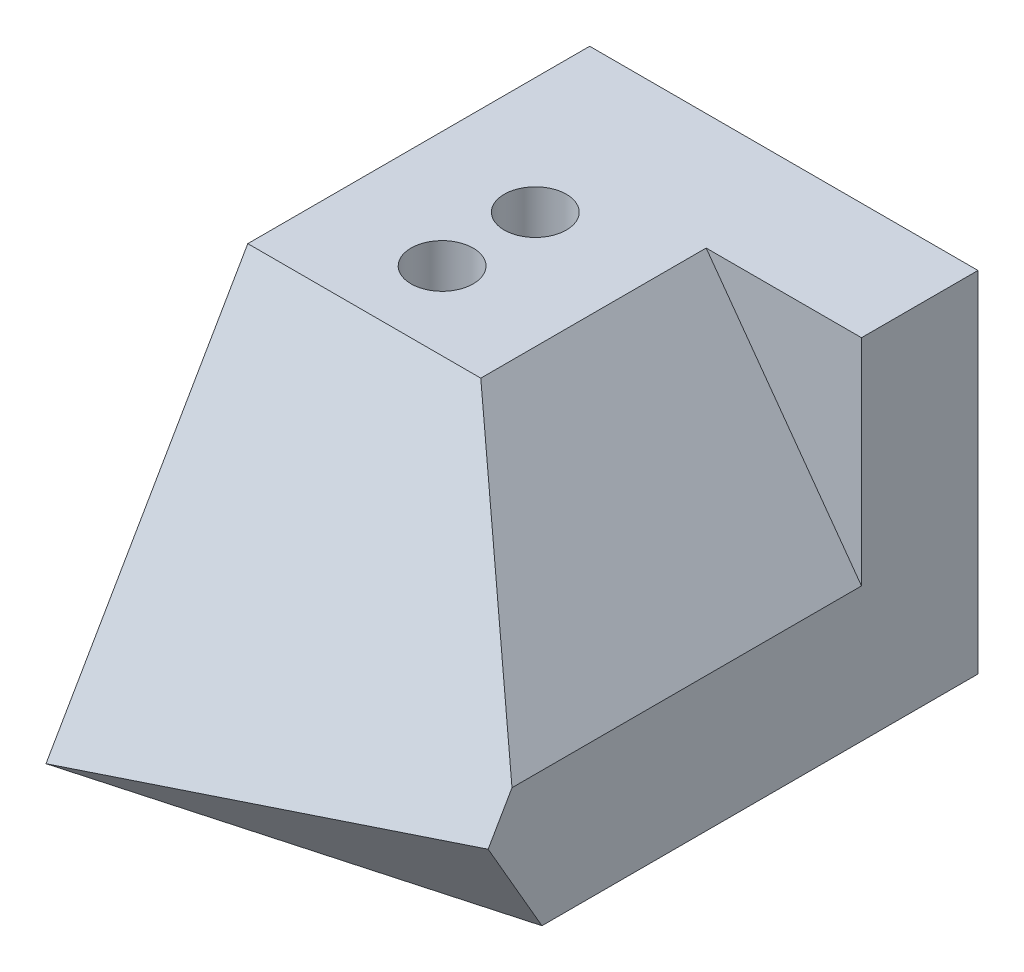
ISO-10303-21;
HEADER;
FILE_DESCRIPTION(('STEP AP214'),'2;1');
FILE_NAME('part.step','',(''),(''),'','','');
FILE_SCHEMA(('AUTOMOTIVE_DESIGN { 1 0 10303 214 1 1 1 1 }'));
ENDSEC;
DATA;
#1=APPLICATION_CONTEXT('core data for automotive mechanical design processes');
#2=APPLICATION_PROTOCOL_DEFINITION('international standard','automotive_design',2000,#1);
#3=PRODUCT_CONTEXT('',#1,'mechanical');
#4=PRODUCT('Part','Part','',(#3));
#5=PRODUCT_RELATED_PRODUCT_CATEGORY('part','',(#4));
#6=PRODUCT_DEFINITION_FORMATION('','',#4);
#7=PRODUCT_DEFINITION_CONTEXT('part definition',#1,'design');
#8=PRODUCT_DEFINITION('design','',#6,#7);
#9=PRODUCT_DEFINITION_SHAPE('','',#8);
#10=(LENGTH_UNIT() NAMED_UNIT(*) SI_UNIT(.MILLI.,.METRE.));
#11=(NAMED_UNIT(*) PLANE_ANGLE_UNIT() SI_UNIT($,.RADIAN.));
#12=(NAMED_UNIT(*) SI_UNIT($,.STERADIAN.) SOLID_ANGLE_UNIT());
#13=UNCERTAINTY_MEASURE_WITH_UNIT(LENGTH_MEASURE(1.E-05),#10,'distance_accuracy_value','');
#14=(GEOMETRIC_REPRESENTATION_CONTEXT(3) GLOBAL_UNCERTAINTY_ASSIGNED_CONTEXT((#13)) GLOBAL_UNIT_ASSIGNED_CONTEXT((#10,
#11,#12)) REPRESENTATION_CONTEXT('',''));
#15=CARTESIAN_POINT('',(0.,0.,0.));
#16=DIRECTION('',(0.,0.,1.));
#17=DIRECTION('',(1.,0.,0.));
#18=AXIS2_PLACEMENT_3D('',#15,#16,#17);
#19=CARTESIAN_POINT('',(50.,45.,35.));
#20=DIRECTION('',(-1.,0.,0.));
#21=DIRECTION('',(0.,0.,1.));
#22=AXIS2_PLACEMENT_3D('',#19,#20,#21);
#23=PLANE('',#22);
#24=DIRECTION('',(0.,0.,-1.));
#25=VECTOR('',#24,1.);
#26=CARTESIAN_POINT('',(50.,17.3205080756888,35.));
#27=LINE('',#26,#25);
#28=CARTESIAN_POINT('',(50.,17.3205080756888,25.0000000000001));
#29=VERTEX_POINT('',#28);
#30=CARTESIAN_POINT('',(50.,17.3205080756888,-20.));
#31=VERTEX_POINT('',#30);
#32=EDGE_CURVE('E196',#29,#31,#27,.T.);
#33=ORIENTED_EDGE('',*,*,#32,.F.);
#34=DIRECTION('',(0.,0.866025403784442,-0.499999999999995));
#35=VECTOR('',#34,1.);
#36=CARTESIAN_POINT('',(50.,15.1554445662276,26.2500000000002));
#37=LINE('',#36,#35);
#38=CARTESIAN_POINT('',(50.,12.,28.0717967697246));
#39=VERTEX_POINT('',#38);
#40=EDGE_CURVE('E141',#39,#29,#37,.T.);
#41=ORIENTED_EDGE('',*,*,#40,.F.);
#42=DIRECTION('',(0.,0.86602540378444,0.499999999999998));
#43=VECTOR('',#42,1.);
#44=CARTESIAN_POINT('',(50.,-48.6217782649108,-6.92820323027527));
#45=LINE('',#44,#43);
#46=CARTESIAN_POINT('',(50.,0.,21.1435935394491));
#47=VERTEX_POINT('',#46);
#48=EDGE_CURVE('E61',#47,#39,#45,.T.);
#49=ORIENTED_EDGE('',*,*,#48,.F.);
#50=DIRECTION('',(0.,0.,-1.));
#51=VECTOR('',#50,1.);
#52=CARTESIAN_POINT('',(50.,0.,35.));
#53=LINE('',#52,#51);
#54=CARTESIAN_POINT('',(50.,0.,-35.));
#55=VERTEX_POINT('',#54);
#56=EDGE_CURVE('E114',#47,#55,#53,.T.);
#57=ORIENTED_EDGE('',*,*,#56,.T.);
#58=DIRECTION('',(0.,1.,0.));
#59=VECTOR('',#58,1.);
#60=CARTESIAN_POINT('',(50.,45.,-35.));
#61=LINE('',#60,#59);
#62=CARTESIAN_POINT('',(50.,45.,-35.));
#63=VERTEX_POINT('',#62);
#64=EDGE_CURVE('E112',#55,#63,#61,.T.);
#65=ORIENTED_EDGE('',*,*,#64,.T.);
#66=DIRECTION('',(0.,0.,-1.));
#67=VECTOR('',#66,1.);
#68=CARTESIAN_POINT('',(50.,45.,35.));
#69=LINE('',#68,#67);
#70=CARTESIAN_POINT('',(50.,45.,-20.));
#71=VERTEX_POINT('',#70);
#72=EDGE_CURVE('E107',#71,#63,#69,.T.);
#73=ORIENTED_EDGE('',*,*,#72,.F.);
#74=DIRECTION('',(0.,1.,0.));
#75=VECTOR('',#74,1.);
#76=CARTESIAN_POINT('',(50.,0.,-20.));
#77=LINE('',#76,#75);
#78=EDGE_CURVE('E95',#31,#71,#77,.T.);
#79=ORIENTED_EDGE('',*,*,#78,.F.);
#80=EDGE_LOOP('',(#33,#41,#49,#57,#65,#73,#79));
#81=FACE_BOUND('',#80,.T.);
#82=ADVANCED_FACE('F39',(#81),#23,.F.);
#83=CARTESIAN_POINT('',(0.,45.,35.));
#84=DIRECTION('',(0.,-1.,0.));
#85=DIRECTION('',(0.,0.,-1.));
#86=AXIS2_PLACEMENT_3D('',#83,#84,#85);
#87=PLANE('',#86);
#88=CARTESIAN_POINT('',(15.,45.,-0.999999999999997));
#89=DIRECTION('',(0.,1.,0.));
#90=DIRECTION('',(0.,0.,1.));
#91=AXIS2_PLACEMENT_3D('',#88,#89,#90);
#92=CIRCLE('',#91,4.);
#93=CARTESIAN_POINT('',(15.,45.,3.));
#94=VERTEX_POINT('',#93);
#95=EDGE_CURVE('E172',#94,#94,#92,.T.);
#96=ORIENTED_EDGE('',*,*,#95,.F.);
#97=EDGE_LOOP('',(#96));
#98=FACE_BOUND('',#97,.T.);
#99=CARTESIAN_POINT('',(15.,45.,-13.));
#100=DIRECTION('',(0.,1.,0.));
#101=DIRECTION('',(0.,0.,1.));
#102=AXIS2_PLACEMENT_3D('',#99,#100,#101);
#103=CIRCLE('',#102,4.);
#104=CARTESIAN_POINT('',(15.,45.,-9.));
#105=VERTEX_POINT('',#104);
#106=EDGE_CURVE('E175',#105,#105,#103,.T.);
#107=ORIENTED_EDGE('',*,*,#106,.F.);
#108=EDGE_LOOP('',(#107));
#109=FACE_BOUND('',#108,.T.);
#110=DIRECTION('',(0.,0.,-1.));
#111=VECTOR('',#110,1.);
#112=CARTESIAN_POINT('',(30.,45.,35.));
#113=LINE('',#112,#111);
#114=CARTESIAN_POINT('',(30.,45.,9.01923788646722));
#115=VERTEX_POINT('',#114);
#116=CARTESIAN_POINT('',(30.,45.,-20.));
#117=VERTEX_POINT('',#116);
#118=EDGE_CURVE('E54',#115,#117,#113,.T.);
#119=ORIENTED_EDGE('',*,*,#118,.T.);
#120=DIRECTION('',(-1.,0.,0.));
#121=VECTOR('',#120,1.);
#122=CARTESIAN_POINT('',(0.,45.,-20.));
#123=LINE('',#122,#121);
#124=EDGE_CURVE('E98',#71,#117,#123,.T.);
#125=ORIENTED_EDGE('',*,*,#124,.F.);
#126=ORIENTED_EDGE('',*,*,#72,.T.);
#127=DIRECTION('',(-1.,0.,0.));
#128=VECTOR('',#127,1.);
#129=CARTESIAN_POINT('',(0.,45.,-35.));
#130=LINE('',#129,#128);
#131=CARTESIAN_POINT('',(0.,45.,-35.));
#132=VERTEX_POINT('',#131);
#133=EDGE_CURVE('E118',#63,#132,#130,.T.);
#134=ORIENTED_EDGE('',*,*,#133,.T.);
#135=DIRECTION('',(0.,0.,-1.));
#136=VECTOR('',#135,1.);
#137=CARTESIAN_POINT('',(0.,45.,35.));
#138=LINE('',#137,#136);
#139=CARTESIAN_POINT('',(0.,45.,9.01923788646721));
#140=VERTEX_POINT('',#139);
#141=EDGE_CURVE('E115',#140,#132,#138,.T.);
#142=ORIENTED_EDGE('',*,*,#141,.F.);
#143=DIRECTION('',(-1.,0.,0.));
#144=VECTOR('',#143,1.);
#145=CARTESIAN_POINT('',(50.,45.,9.01923788646721));
#146=LINE('',#145,#144);
#147=EDGE_CURVE('E138',#115,#140,#146,.T.);
#148=ORIENTED_EDGE('',*,*,#147,.F.);
#149=EDGE_LOOP('',(#119,#125,#126,#134,#142,#148));
#150=FACE_BOUND('',#149,.T.);
#151=ADVANCED_FACE('F105',(#98,#109,#150),#87,.F.);
#152=CARTESIAN_POINT('',(50.,15.1554445662276,26.2500000000002));
#153=DIRECTION('',(0.,0.499999999999995,0.866025403784442));
#154=DIRECTION('',(0.,-0.866025403784442,0.499999999999995));
#155=AXIS2_PLACEMENT_3D('',#152,#153,#154);
#156=PLANE('',#155);
#157=ORIENTED_EDGE('',*,*,#40,.T.);
#158=DIRECTION('',(-0.530457508835614,0.73413971660028,-0.423855763001961));
#159=VECTOR('',#158,1.);
#160=CARTESIAN_POINT('',(51.1241873607383,15.7646613270404,25.8982685391501));
#161=LINE('',#160,#159);
#162=EDGE_CURVE('E11',#29,#115,#161,.T.);
#163=ORIENTED_EDGE('',*,*,#162,.T.);
#164=ORIENTED_EDGE('',*,*,#147,.T.);
#165=DIRECTION('',(0.,0.866025403784442,-0.499999999999995));
#166=VECTOR('',#165,1.);
#167=CARTESIAN_POINT('',(0.,15.1554445662276,26.2500000000002));
#168=LINE('',#167,#166);
#169=CARTESIAN_POINT('',(0.,0.,35.));
#170=VERTEX_POINT('',#169);
#171=EDGE_CURVE('E192',#170,#140,#168,.T.);
#172=ORIENTED_EDGE('',*,*,#171,.F.);
#173=DIRECTION('',(-0.963679180614625,-0.23128300334751,0.133531304241668));
#174=VECTOR('',#173,1.);
#175=CARTESIAN_POINT('',(4.50384682503045,1.08092323800731,34.3759286775632));
#176=LINE('',#175,#174);
#177=EDGE_CURVE('E177',#39,#170,#176,.T.);
#178=ORIENTED_EDGE('',*,*,#177,.F.);
#179=EDGE_LOOP('',(#157,#163,#164,#172,#178));
#180=FACE_BOUND('',#179,.T.);
#181=ADVANCED_FACE('F163',(#180),#156,.T.);
#182=CARTESIAN_POINT('',(0.,45.,35.));
#183=DIRECTION('',(1.,0.,0.));
#184=DIRECTION('',(0.,1.,0.));
#185=AXIS2_PLACEMENT_3D('',#182,#183,#184);
#186=PLANE('',#185);
#187=ORIENTED_EDGE('',*,*,#171,.T.);
#188=ORIENTED_EDGE('',*,*,#141,.T.);
#189=DIRECTION('',(0.,-1.,0.));
#190=VECTOR('',#189,1.);
#191=CARTESIAN_POINT('',(0.,45.,-35.));
#192=LINE('',#191,#190);
#193=CARTESIAN_POINT('',(0.,0.,-35.));
#194=VERTEX_POINT('',#193);
#195=EDGE_CURVE('E135',#132,#194,#192,.T.);
#196=ORIENTED_EDGE('',*,*,#195,.T.);
#197=DIRECTION('',(0.,0.,-1.));
#198=VECTOR('',#197,1.);
#199=CARTESIAN_POINT('',(0.,0.,35.));
#200=LINE('',#199,#198);
#201=EDGE_CURVE('E47',#170,#194,#200,.T.);
#202=ORIENTED_EDGE('',*,*,#201,.F.);
#203=EDGE_LOOP('',(#187,#188,#196,#202));
#204=FACE_BOUND('',#203,.T.);
#205=ADVANCED_FACE('F41',(#204),#186,.F.);
#206=CARTESIAN_POINT('',(0.,0.,35.));
#207=DIRECTION('',(0.,1.,0.));
#208=DIRECTION('',(0.,0.,1.));
#209=AXIS2_PLACEMENT_3D('',#206,#207,#208);
#210=PLANE('',#209);
#211=CARTESIAN_POINT('',(15.,0.,-13.));
#212=DIRECTION('',(0.,1.,0.));
#213=DIRECTION('',(0.,0.,1.));
#214=AXIS2_PLACEMENT_3D('',#211,#212,#213);
#215=CIRCLE('',#214,4.);
#216=CARTESIAN_POINT('',(15.,0.,-9.));
#217=VERTEX_POINT('',#216);
#218=EDGE_CURVE('E178',#217,#217,#215,.T.);
#219=ORIENTED_EDGE('',*,*,#218,.T.);
#220=EDGE_LOOP('',(#219));
#221=FACE_BOUND('',#220,.T.);
#222=CARTESIAN_POINT('',(15.,0.,-0.999999999999997));
#223=DIRECTION('',(0.,1.,0.));
#224=DIRECTION('',(0.,0.,1.));
#225=AXIS2_PLACEMENT_3D('',#222,#223,#224);
#226=CIRCLE('',#225,4.);
#227=CARTESIAN_POINT('',(15.,0.,3.));
#228=VERTEX_POINT('',#227);
#229=EDGE_CURVE('E182',#228,#228,#226,.T.);
#230=ORIENTED_EDGE('',*,*,#229,.T.);
#231=EDGE_LOOP('',(#230));
#232=FACE_BOUND('',#231,.T.);
#233=ORIENTED_EDGE('',*,*,#56,.F.);
#234=DIRECTION('',(-0.963679180614625,0.,0.267062608483337));
#235=VECTOR('',#234,1.);
#236=CARTESIAN_POINT('',(0.,0.,35.));
#237=LINE('',#236,#235);
#238=EDGE_CURVE('E130',#47,#170,#237,.T.);
#239=ORIENTED_EDGE('',*,*,#238,.T.);
#240=ORIENTED_EDGE('',*,*,#201,.T.);
#241=DIRECTION('',(1.,0.,0.));
#242=VECTOR('',#241,1.);
#243=CARTESIAN_POINT('',(0.,0.,-35.));
#244=LINE('',#243,#242);
#245=EDGE_CURVE('E129',#194,#55,#244,.T.);
#246=ORIENTED_EDGE('',*,*,#245,.T.);
#247=EDGE_LOOP('',(#233,#239,#240,#246));
#248=FACE_BOUND('',#247,.T.);
#249=ADVANCED_FACE('F128',(#221,#232,#248),#210,.F.);
#250=CARTESIAN_POINT('',(0.,0.,-35.));
#251=DIRECTION('',(0.,0.,1.));
#252=DIRECTION('',(1.,0.,0.));
#253=AXIS2_PLACEMENT_3D('',#250,#251,#252);
#254=PLANE('',#253);
#255=ORIENTED_EDGE('',*,*,#195,.F.);
#256=ORIENTED_EDGE('',*,*,#133,.F.);
#257=ORIENTED_EDGE('',*,*,#64,.F.);
#258=ORIENTED_EDGE('',*,*,#245,.F.);
#259=EDGE_LOOP('',(#255,#256,#257,#258));
#260=FACE_BOUND('',#259,.T.);
#261=ADVANCED_FACE('F145',(#260),#254,.F.);
#262=CARTESIAN_POINT('',(4.50384682503045,-59.5408550269035,-0.624071322436685));
#263=DIRECTION('',(-0.233372952475322,0.486193650990257,-0.84211210583254));
#264=DIRECTION('',(0.,0.86602540378444,0.499999999999998));
#265=AXIS2_PLACEMENT_3D('',#262,#263,#264);
#266=PLANE('',#265);
#267=ORIENTED_EDGE('',*,*,#48,.T.);
#268=ORIENTED_EDGE('',*,*,#177,.T.);
#269=ORIENTED_EDGE('',*,*,#238,.F.);
#270=EDGE_LOOP('',(#267,#268,#269));
#271=FACE_BOUND('',#270,.T.);
#272=ADVANCED_FACE('F147',(#271),#266,.F.);
#273=CARTESIAN_POINT('',(15.,45.,-0.999999999999997));
#274=DIRECTION('',(0.,-1.,0.));
#275=DIRECTION('',(0.,0.,-1.));
#276=AXIS2_PLACEMENT_3D('',#273,#274,#275);
#277=CYLINDRICAL_SURFACE('',#276,4.);
#278=ORIENTED_EDGE('',*,*,#95,.T.);
#279=EDGE_LOOP('',(#278));
#280=FACE_BOUND('',#279,.T.);
#281=ORIENTED_EDGE('',*,*,#229,.F.);
#282=EDGE_LOOP('',(#281));
#283=FACE_BOUND('',#282,.T.);
#284=ADVANCED_FACE('F153',(#280,#283),#277,.F.);
#285=CARTESIAN_POINT('',(15.,45.,-13.));
#286=DIRECTION('',(0.,-1.,0.));
#287=DIRECTION('',(0.,0.,-1.));
#288=AXIS2_PLACEMENT_3D('',#285,#286,#287);
#289=CYLINDRICAL_SURFACE('',#288,4.);
#290=ORIENTED_EDGE('',*,*,#106,.T.);
#291=EDGE_LOOP('',(#290));
#292=FACE_BOUND('',#291,.T.);
#293=ORIENTED_EDGE('',*,*,#218,.F.);
#294=EDGE_LOOP('',(#293));
#295=FACE_BOUND('',#294,.T.);
#296=ADVANCED_FACE('F199',(#292,#295),#289,.F.);
#297=CARTESIAN_POINT('',(41.0718993436287,29.6767725765622,35.));
#298=DIRECTION('',(0.810550559828826,0.585668669096424,0.));
#299=DIRECTION('',(-0.585668669096424,0.810550559828826,0.));
#300=AXIS2_PLACEMENT_3D('',#297,#298,#299);
#301=PLANE('',#300);
#302=ORIENTED_EDGE('',*,*,#32,.T.);
#303=DIRECTION('',(0.585668669096424,-0.810550559828826,0.));
#304=VECTOR('',#303,1.);
#305=CARTESIAN_POINT('',(41.0718993436287,29.6767725765622,-20.));
#306=LINE('',#305,#304);
#307=EDGE_CURVE('E99',#117,#31,#306,.T.);
#308=ORIENTED_EDGE('',*,*,#307,.F.);
#309=ORIENTED_EDGE('',*,*,#118,.F.);
#310=ORIENTED_EDGE('',*,*,#162,.F.);
#311=EDGE_LOOP('',(#302,#308,#309,#310));
#312=FACE_BOUND('',#311,.T.);
#313=ADVANCED_FACE('F195',(#312),#301,.T.);
#314=CARTESIAN_POINT('',(0.,0.,-20.));
#315=DIRECTION('',(0.,0.,1.));
#316=DIRECTION('',(1.,0.,0.));
#317=AXIS2_PLACEMENT_3D('',#314,#315,#316);
#318=PLANE('',#317);
#319=ORIENTED_EDGE('',*,*,#78,.T.);
#320=ORIENTED_EDGE('',*,*,#124,.T.);
#321=ORIENTED_EDGE('',*,*,#307,.T.);
#322=EDGE_LOOP('',(#319,#320,#321));
#323=FACE_BOUND('',#322,.T.);
#324=ADVANCED_FACE('F97',(#323),#318,.T.);
#325=CLOSED_SHELL('',(#82,#151,#181,#205,#249,#261,#272,#284,#296,#313,#324));
#326=MANIFOLD_SOLID_BREP('B2',#325);
#327=ADVANCED_BREP_SHAPE_REPRESENTATION('',(#18,#326),#14);
#328=SHAPE_DEFINITION_REPRESENTATION(#9,#327);
ENDSEC;
END-ISO-10303-21;
